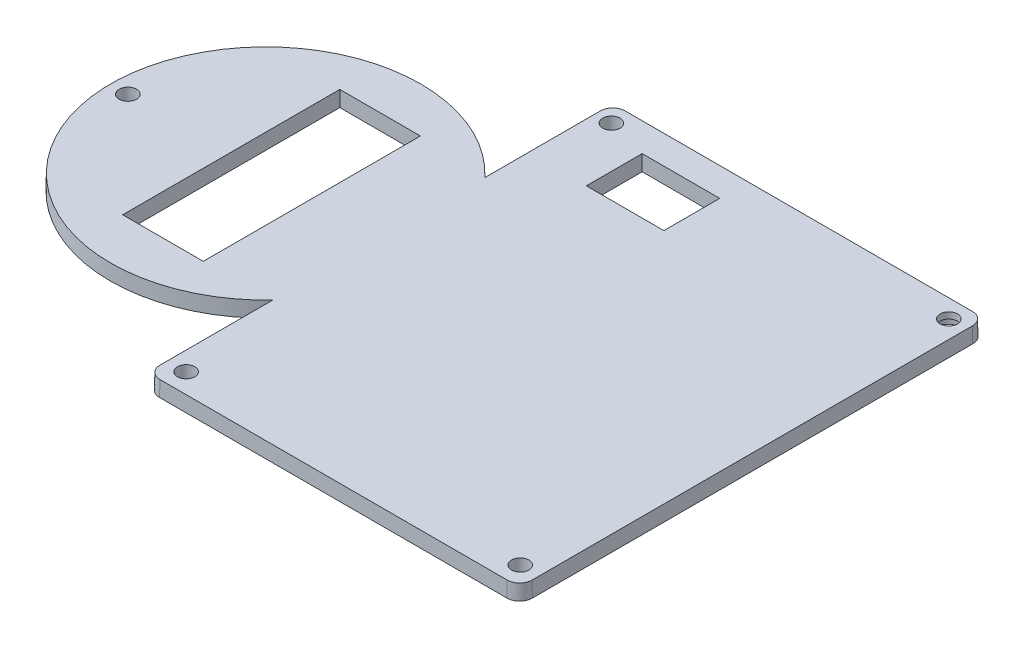
ISO-10303-21;
HEADER;
FILE_DESCRIPTION(('STEP AP214'),'2;1');
FILE_NAME('part.step','',(''),(''),'','','');
FILE_SCHEMA(('AUTOMOTIVE_DESIGN { 1 0 10303 214 1 1 1 1 }'));
ENDSEC;
DATA;
#1=APPLICATION_CONTEXT('core data for automotive mechanical design processes');
#2=APPLICATION_PROTOCOL_DEFINITION('international standard','automotive_design',2000,#1);
#3=PRODUCT_CONTEXT('',#1,'mechanical');
#4=PRODUCT('Part','Part','',(#3));
#5=PRODUCT_RELATED_PRODUCT_CATEGORY('part','',(#4));
#6=PRODUCT_DEFINITION_FORMATION('','',#4);
#7=PRODUCT_DEFINITION_CONTEXT('part definition',#1,'design');
#8=PRODUCT_DEFINITION('design','',#6,#7);
#9=PRODUCT_DEFINITION_SHAPE('','',#8);
#10=(LENGTH_UNIT() NAMED_UNIT(*) SI_UNIT(.MILLI.,.METRE.));
#11=(NAMED_UNIT(*) PLANE_ANGLE_UNIT() SI_UNIT($,.RADIAN.));
#12=(NAMED_UNIT(*) SI_UNIT($,.STERADIAN.) SOLID_ANGLE_UNIT());
#13=UNCERTAINTY_MEASURE_WITH_UNIT(LENGTH_MEASURE(1.E-05),#10,'distance_accuracy_value','');
#14=(GEOMETRIC_REPRESENTATION_CONTEXT(3) GLOBAL_UNCERTAINTY_ASSIGNED_CONTEXT((#13)) GLOBAL_UNIT_ASSIGNED_CONTEXT((#10,
#11,#12)) REPRESENTATION_CONTEXT('',''));
#15=CARTESIAN_POINT('',(0.,0.,0.));
#16=DIRECTION('',(0.,0.,1.));
#17=DIRECTION('',(1.,0.,0.));
#18=AXIS2_PLACEMENT_3D('',#15,#16,#17);
#19=CARTESIAN_POINT('',(13.7088550827018,5.,-147.164227743625));
#20=DIRECTION('',(-0.999847695156391,0.0174524064372835,0.));
#21=DIRECTION('',(-0.0174524064372835,-0.999847695156391,0.));
#22=AXIS2_PLACEMENT_3D('',#19,#20,#21);
#23=PLANE('',#22);
#24=DIRECTION('',(0.,0.,-1.));
#25=VECTOR('',#24,1.);
#26=CARTESIAN_POINT('',(13.6215797580607,0.,-147.164227743625));
#27=LINE('',#26,#25);
#28=CARTESIAN_POINT('',(13.6215797580607,0.,-37.3430465346885));
#29=VERTEX_POINT('',#28);
#30=CARTESIAN_POINT('',(13.6215797580607,0.,-1.16422774362512));
#31=VERTEX_POINT('',#30);
#32=EDGE_CURVE('E436',#29,#31,#27,.F.);
#33=ORIENTED_EDGE('',*,*,#32,.T.);
#34=DIRECTION('',(-0.0174524064372835,-0.999847695156391,0.));
#35=VECTOR('',#34,1.);
#36=CARTESIAN_POINT('',(13.7088550827018,5.,-1.16422774362512));
#37=LINE('',#36,#35);
#38=CARTESIAN_POINT('',(13.7088550827018,5.,-1.16422774362512));
#39=VERTEX_POINT('',#38);
#40=EDGE_CURVE('E189',#31,#39,#37,.F.);
#41=ORIENTED_EDGE('',*,*,#40,.T.);
#42=DIRECTION('',(0.,0.,1.));
#43=VECTOR('',#42,1.);
#44=CARTESIAN_POINT('',(13.7088550827018,5.,-147.164227743625));
#45=LINE('',#44,#43);
#46=CARTESIAN_POINT('',(13.7088550827018,5.,-37.5631420610925));
#47=VERTEX_POINT('',#46);
#48=EDGE_CURVE('E393',#47,#39,#45,.T.);
#49=ORIENTED_EDGE('',*,*,#48,.F.);
#50=CARTESIAN_POINT('',(13.6215797580607,0.,-37.3430465346885));
#51=CARTESIAN_POINT('',(13.63612573574,0.833338503129155,-37.3796116421935));
#52=CARTESIAN_POINT('',(13.6506716682997,1.6666744213586,-37.4162354898129));
#53=CARTESIAN_POINT('',(13.6797634431801,3.33334108802526,-37.4896006652809));
#54=CARTESIAN_POINT('',(13.6943092855008,4.16667183646249,-37.5263419931294));
#55=CARTESIAN_POINT('',(13.7088550827018,5.,-37.5631420610925));
#56=B_SPLINE_CURVE_WITH_KNOTS('',3,(#50,#51,#52,#53,#54,#55),.UNSPECIFIED.,.F.,.F.,(4,2,4),(0.,
2.50280138780888,5.00560277563944),.UNSPECIFIED.);
#57=EDGE_CURVE('E209',#29,#47,#56,.T.);
#58=ORIENTED_EDGE('',*,*,#57,.F.);
#59=EDGE_LOOP('',(#33,#41,#49,#58));
#60=FACE_BOUND('',#59,.T.);
#61=ADVANCED_FACE('F39',(#60),#23,.T.);
#62=CARTESIAN_POINT('',(13.7088550827018,5.,-147.164227743625));
#63=DIRECTION('',(-0.999847695156391,0.0174524064372835,0.));
#64=DIRECTION('',(-0.0174524064372835,-0.999847695156391,0.));
#65=AXIS2_PLACEMENT_3D('',#62,#63,#64);
#66=PLANE('',#65);
#67=CARTESIAN_POINT('',(13.7088550827018,5.,-143.164227743625));
#68=VERTEX_POINT('',#67);
#69=CARTESIAN_POINT('',(13.7088550827018,5.,-105.933775442334));
#70=VERTEX_POINT('',#69);
#71=EDGE_CURVE('E390',#68,#70,#45,.T.);
#72=ORIENTED_EDGE('',*,*,#71,.F.);
#73=DIRECTION('',(-0.0174524064372835,-0.999847695156391,0.));
#74=VECTOR('',#73,1.);
#75=CARTESIAN_POINT('',(13.7088550827018,5.,-143.164227743625));
#76=LINE('',#75,#74);
#77=CARTESIAN_POINT('',(13.6215797580607,0.,-143.164227743625));
#78=VERTEX_POINT('',#77);
#79=EDGE_CURVE('E191',#68,#78,#76,.T.);
#80=ORIENTED_EDGE('',*,*,#79,.T.);
#81=DIRECTION('',(0.,0.,-1.));
#82=VECTOR('',#81,1.);
#83=CARTESIAN_POINT('',(13.6215797580607,0.,-147.164227743625));
#84=LINE('',#83,#82);
#85=CARTESIAN_POINT('',(13.6215797580607,0.,-106.153870968738));
#86=VERTEX_POINT('',#85);
#87=EDGE_CURVE('E433',#78,#86,#84,.F.);
#88=ORIENTED_EDGE('',*,*,#87,.T.);
#89=CARTESIAN_POINT('',(13.7088550827018,5.,-105.933775442334));
#90=CARTESIAN_POINT('',(13.6943092855008,4.16667183646249,-105.970575510297));
#91=CARTESIAN_POINT('',(13.6797634431801,3.33334108802526,-106.007316838146));
#92=CARTESIAN_POINT('',(13.6506716682997,1.6666744213586,-106.080682013614));
#93=CARTESIAN_POINT('',(13.63612573574,0.833338503129156,-106.117305861233));
#94=CARTESIAN_POINT('',(13.6215797580607,0.,-106.153870968738));
#95=B_SPLINE_CURVE_WITH_KNOTS('',3,(#89,#90,#91,#92,#93,#94),.UNSPECIFIED.,.F.,.F.,(4,2,4),(0.,
2.50280138783056,5.00560277563944),.UNSPECIFIED.);
#96=EDGE_CURVE('E200',#70,#86,#95,.T.);
#97=ORIENTED_EDGE('',*,*,#96,.F.);
#98=EDGE_LOOP('',(#72,#80,#88,#97));
#99=FACE_BOUND('',#98,.T.);
#100=ADVANCED_FACE('F217',(#99),#66,.T.);
#101=CARTESIAN_POINT('',(13.7088550827018,5.,2.83577225637488));
#102=DIRECTION('',(0.,0.0174524064372835,0.999847695156391));
#103=DIRECTION('',(0.,-0.999847695156391,0.0174524064372835));
#104=AXIS2_PLACEMENT_3D('',#101,#102,#103);
#105=PLANE('',#104);
#106=DIRECTION('',(-1.,0.,0.));
#107=VECTOR('',#106,1.);
#108=CARTESIAN_POINT('',(13.7088550827018,0.,2.92304758101597));
#109=LINE('',#108,#107);
#110=CARTESIAN_POINT('',(17.7088550827018,0.,2.92304758101597));
#111=VERTEX_POINT('',#110);
#112=CARTESIAN_POINT('',(129.708855082702,0.,2.92304758101597));
#113=VERTEX_POINT('',#112);
#114=EDGE_CURVE('E435',#111,#113,#109,.F.);
#115=ORIENTED_EDGE('',*,*,#114,.T.);
#116=DIRECTION('',(0.,-0.999847695156391,0.0174524064372835));
#117=VECTOR('',#116,1.);
#118=CARTESIAN_POINT('',(129.708855082702,5.,2.83577225637488));
#119=LINE('',#118,#117);
#120=CARTESIAN_POINT('',(129.708855082702,5.,2.83577225637488));
#121=VERTEX_POINT('',#120);
#122=EDGE_CURVE('E43',#113,#121,#119,.F.);
#123=ORIENTED_EDGE('',*,*,#122,.T.);
#124=DIRECTION('',(1.,0.,0.));
#125=VECTOR('',#124,1.);
#126=CARTESIAN_POINT('',(13.7088550827018,5.,2.83577225637488));
#127=LINE('',#126,#125);
#128=CARTESIAN_POINT('',(17.7088550827018,5.,2.83577225637488));
#129=VERTEX_POINT('',#128);
#130=EDGE_CURVE('E392',#129,#121,#127,.T.);
#131=ORIENTED_EDGE('',*,*,#130,.F.);
#132=DIRECTION('',(0.,-0.999847695156391,0.0174524064372835));
#133=VECTOR('',#132,1.);
#134=CARTESIAN_POINT('',(17.7088550827018,5.,2.83577225637488));
#135=LINE('',#134,#133);
#136=EDGE_CURVE('E302',#129,#111,#135,.T.);
#137=ORIENTED_EDGE('',*,*,#136,.T.);
#138=EDGE_LOOP('',(#115,#123,#131,#137));
#139=FACE_BOUND('',#138,.T.);
#140=ADVANCED_FACE('F41',(#139),#105,.T.);
#141=CARTESIAN_POINT('',(133.708855082702,5.,-147.164227743625));
#142=DIRECTION('',(0.999847695156391,0.0174524064372835,0.));
#143=DIRECTION('',(-0.0174524064372835,0.999847695156391,0.));
#144=AXIS2_PLACEMENT_3D('',#141,#142,#143);
#145=PLANE('',#144);
#146=DIRECTION('',(0.,0.,1.));
#147=VECTOR('',#146,1.);
#148=CARTESIAN_POINT('',(133.708855082702,5.,-147.164227743625));
#149=LINE('',#148,#147);
#150=CARTESIAN_POINT('',(133.708855082702,5.,-143.164227743625));
#151=VERTEX_POINT('',#150);
#152=CARTESIAN_POINT('',(133.708855082702,5.,-1.16422774362512));
#153=VERTEX_POINT('',#152);
#154=EDGE_CURVE('E170',#151,#153,#149,.T.);
#155=ORIENTED_EDGE('',*,*,#154,.T.);
#156=DIRECTION('',(0.0174524064372835,-0.999847695156391,0.));
#157=VECTOR('',#156,1.);
#158=CARTESIAN_POINT('',(133.708855082702,5.,-1.16422774362512));
#159=LINE('',#158,#157);
#160=CARTESIAN_POINT('',(133.796130407343,0.,-1.16422774362512));
#161=VERTEX_POINT('',#160);
#162=EDGE_CURVE('E195',#153,#161,#159,.T.);
#163=ORIENTED_EDGE('',*,*,#162,.T.);
#164=DIRECTION('',(0.,0.,1.));
#165=VECTOR('',#164,1.);
#166=CARTESIAN_POINT('',(133.796130407343,0.,-147.164227743625));
#167=LINE('',#166,#165);
#168=CARTESIAN_POINT('',(133.796130407343,0.,-143.164227743625));
#169=VERTEX_POINT('',#168);
#170=EDGE_CURVE('E431',#169,#161,#167,.T.);
#171=ORIENTED_EDGE('',*,*,#170,.F.);
#172=DIRECTION('',(0.0174524064372835,-0.999847695156391,0.));
#173=VECTOR('',#172,1.);
#174=CARTESIAN_POINT('',(133.708855082702,5.,-143.164227743625));
#175=LINE('',#174,#173);
#176=EDGE_CURVE('E185',#169,#151,#175,.F.);
#177=ORIENTED_EDGE('',*,*,#176,.T.);
#178=EDGE_LOOP('',(#155,#163,#171,#177));
#179=FACE_BOUND('',#178,.T.);
#180=ADVANCED_FACE('F280',(#179),#145,.T.);
#181=CARTESIAN_POINT('',(13.7088550827018,5.,-147.164227743625));
#182=DIRECTION('',(0.,0.0174524064372835,-0.999847695156391));
#183=DIRECTION('',(0.,0.999847695156391,0.0174524064372835));
#184=AXIS2_PLACEMENT_3D('',#181,#182,#183);
#185=PLANE('',#184);
#186=DIRECTION('',(1.,0.,0.));
#187=VECTOR('',#186,1.);
#188=CARTESIAN_POINT('',(13.7088550827018,5.,-147.164227743625));
#189=LINE('',#188,#187);
#190=CARTESIAN_POINT('',(17.7088550827018,5.,-147.164227743625));
#191=VERTEX_POINT('',#190);
#192=CARTESIAN_POINT('',(129.708855082702,5.,-147.164227743625));
#193=VERTEX_POINT('',#192);
#194=EDGE_CURVE('E167',#191,#193,#189,.T.);
#195=ORIENTED_EDGE('',*,*,#194,.T.);
#196=DIRECTION('',(0.,-0.999847695156391,-0.0174524064372835));
#197=VECTOR('',#196,1.);
#198=CARTESIAN_POINT('',(129.708855082702,5.,-147.164227743625));
#199=LINE('',#198,#197);
#200=CARTESIAN_POINT('',(129.708855082702,0.,-147.251503068266));
#201=VERTEX_POINT('',#200);
#202=EDGE_CURVE('E181',#193,#201,#199,.T.);
#203=ORIENTED_EDGE('',*,*,#202,.T.);
#204=DIRECTION('',(1.,0.,0.));
#205=VECTOR('',#204,1.);
#206=CARTESIAN_POINT('',(13.7088550827018,0.,-147.251503068266));
#207=LINE('',#206,#205);
#208=CARTESIAN_POINT('',(17.7088550827018,0.,-147.251503068266));
#209=VERTEX_POINT('',#208);
#210=EDGE_CURVE('E430',#209,#201,#207,.T.);
#211=ORIENTED_EDGE('',*,*,#210,.F.);
#212=DIRECTION('',(0.,-0.999847695156391,-0.0174524064372835));
#213=VECTOR('',#212,1.);
#214=CARTESIAN_POINT('',(17.7088550827018,5.,-147.164227743625));
#215=LINE('',#214,#213);
#216=EDGE_CURVE('E184',#209,#191,#215,.F.);
#217=ORIENTED_EDGE('',*,*,#216,.T.);
#218=EDGE_LOOP('',(#195,#203,#211,#217));
#219=FACE_BOUND('',#218,.T.);
#220=ADVANCED_FACE('F179',(#219),#185,.T.);
#221=CARTESIAN_POINT('',(0.,5.,0.));
#222=DIRECTION('',(0.,1.,0.));
#223=DIRECTION('',(0.,0.,1.));
#224=AXIS2_PLACEMENT_3D('',#221,#222,#223);
#225=PLANE('',#224);
#226=DIRECTION('',(0.,0.,-1.));
#227=VECTOR('',#226,1.);
#228=CARTESIAN_POINT('',(57.3758983763834,5.,-137.99167248453));
#229=LINE('',#228,#227);
#230=CARTESIAN_POINT('',(57.3758983763834,5.,-119.99167248453));
#231=VERTEX_POINT('',#230);
#232=CARTESIAN_POINT('',(57.3758983763834,5.,-137.99167248453));
#233=VERTEX_POINT('',#232);
#234=EDGE_CURVE('E58',#231,#233,#229,.T.);
#235=ORIENTED_EDGE('',*,*,#234,.F.);
#236=DIRECTION('',(1.,0.,0.));
#237=VECTOR('',#236,1.);
#238=CARTESIAN_POINT('',(32.3758983763834,5.,-119.99167248453));
#239=LINE('',#238,#237);
#240=CARTESIAN_POINT('',(32.3758983763834,5.,-119.99167248453));
#241=VERTEX_POINT('',#240);
#242=EDGE_CURVE('E366',#241,#231,#239,.T.);
#243=ORIENTED_EDGE('',*,*,#242,.F.);
#244=DIRECTION('',(0.,0.,1.));
#245=VECTOR('',#244,1.);
#246=CARTESIAN_POINT('',(32.3758983763834,5.,-137.99167248453));
#247=LINE('',#246,#245);
#248=CARTESIAN_POINT('',(32.3758983763834,5.,-137.99167248453));
#249=VERTEX_POINT('',#248);
#250=EDGE_CURVE('E685',#249,#241,#247,.T.);
#251=ORIENTED_EDGE('',*,*,#250,.F.);
#252=DIRECTION('',(-1.,0.,0.));
#253=VECTOR('',#252,1.);
#254=CARTESIAN_POINT('',(32.3758983763834,5.,-137.99167248453));
#255=LINE('',#254,#253);
#256=EDGE_CURVE('E690',#233,#249,#255,.T.);
#257=ORIENTED_EDGE('',*,*,#256,.F.);
#258=EDGE_LOOP('',(#235,#243,#251,#257));
#259=FACE_BOUND('',#258,.T.);
#260=DIRECTION('',(0.,0.,-1.));
#261=VECTOR('',#260,1.);
#262=CARTESIAN_POINT('',(-8.2911449172982,5.,-37.1642277436251));
#263=LINE('',#262,#261);
#264=CARTESIAN_POINT('',(-8.2911449172982,5.,-37.1642277436251));
#265=VERTEX_POINT('',#264);
#266=CARTESIAN_POINT('',(-8.2911449172982,5.,-107.164227743625));
#267=VERTEX_POINT('',#266);
#268=EDGE_CURVE('E354',#265,#267,#263,.T.);
#269=ORIENTED_EDGE('',*,*,#268,.F.);
#270=DIRECTION('',(1.,0.,0.));
#271=VECTOR('',#270,1.);
#272=CARTESIAN_POINT('',(-34.2911449172982,5.,-37.1642277436251));
#273=LINE('',#272,#271);
#274=CARTESIAN_POINT('',(-34.2911449172982,5.,-37.1642277436251));
#275=VERTEX_POINT('',#274);
#276=EDGE_CURVE('E336',#275,#265,#273,.T.);
#277=ORIENTED_EDGE('',*,*,#276,.F.);
#278=DIRECTION('',(0.,0.,1.));
#279=VECTOR('',#278,1.);
#280=CARTESIAN_POINT('',(-34.2911449172982,5.,-37.1642277436251));
#281=LINE('',#280,#279);
#282=CARTESIAN_POINT('',(-34.2911449172982,5.,-107.164227743625));
#283=VERTEX_POINT('',#282);
#284=EDGE_CURVE('E361',#283,#275,#281,.T.);
#285=ORIENTED_EDGE('',*,*,#284,.F.);
#286=DIRECTION('',(-1.,0.,0.));
#287=VECTOR('',#286,1.);
#288=CARTESIAN_POINT('',(-34.2911449172982,5.,-107.164227743625));
#289=LINE('',#288,#287);
#290=EDGE_CURVE('E358',#267,#283,#289,.T.);
#291=ORIENTED_EDGE('',*,*,#290,.F.);
#292=EDGE_LOOP('',(#269,#277,#285,#291));
#293=FACE_BOUND('',#292,.T.);
#294=CARTESIAN_POINT('',(18.9171232014785,5.,-141.531370061939));
#295=DIRECTION('',(0.,1.,0.));
#296=DIRECTION('',(0.,0.,1.));
#297=AXIS2_PLACEMENT_3D('',#294,#295,#296);
#298=CIRCLE('',#297,2.8067);
#299=CARTESIAN_POINT('',(18.9171232014785,5.,-138.724670061939));
#300=VERTEX_POINT('',#299);
#301=EDGE_CURVE('E333',#300,#300,#298,.T.);
#302=ORIENTED_EDGE('',*,*,#301,.F.);
#303=EDGE_LOOP('',(#302));
#304=FACE_BOUND('',#303,.T.);
#305=CARTESIAN_POINT('',(127.969984406632,5.,-141.269223760965));
#306=DIRECTION('',(0.,1.,0.));
#307=DIRECTION('',(0.,0.,1.));
#308=AXIS2_PLACEMENT_3D('',#305,#306,#307);
#309=CIRCLE('',#308,2.8067);
#310=CARTESIAN_POINT('',(127.969984406632,5.,-138.462523760965));
#311=VERTEX_POINT('',#310);
#312=EDGE_CURVE('E374',#311,#311,#309,.T.);
#313=ORIENTED_EDGE('',*,*,#312,.F.);
#314=EDGE_LOOP('',(#313));
#315=FACE_BOUND('',#314,.T.);
#316=CARTESIAN_POINT('',(127.602547563754,5.,-3.45328248038996));
#317=DIRECTION('',(0.,1.,0.));
#318=DIRECTION('',(0.,0.,1.));
#319=AXIS2_PLACEMENT_3D('',#316,#317,#318);
#320=CIRCLE('',#319,2.8067);
#321=CARTESIAN_POINT('',(127.602547563754,5.,-0.646582480389964));
#322=VERTEX_POINT('',#321);
#323=EDGE_CURVE('E378',#322,#322,#320,.T.);
#324=ORIENTED_EDGE('',*,*,#323,.F.);
#325=EDGE_LOOP('',(#324));
#326=FACE_BOUND('',#325,.T.);
#327=CARTESIAN_POINT('',(19.774147178092,5.,-3.57057546629465));
#328=DIRECTION('',(0.,1.,0.));
#329=DIRECTION('',(0.,0.,1.));
#330=AXIS2_PLACEMENT_3D('',#327,#328,#329);
#331=CIRCLE('',#330,2.8067);
#332=CARTESIAN_POINT('',(19.774147178092,5.,-0.76387546629465));
#333=VERTEX_POINT('',#332);
#334=EDGE_CURVE('E382',#333,#333,#331,.T.);
#335=ORIENTED_EDGE('',*,*,#334,.F.);
#336=EDGE_LOOP('',(#335));
#337=FACE_BOUND('',#336,.T.);
#338=CARTESIAN_POINT('',(-67.1156180642392,5.,-71.668740496135));
#339=DIRECTION('',(0.,1.,0.));
#340=DIRECTION('',(0.,0.,1.));
#341=AXIS2_PLACEMENT_3D('',#338,#339,#340);
#342=CIRCLE('',#341,2.8067);
#343=CARTESIAN_POINT('',(-67.1156180642392,5.,-68.862040496135));
#344=VERTEX_POINT('',#343);
#345=EDGE_CURVE('E326',#344,#344,#342,.T.);
#346=ORIENTED_EDGE('',*,*,#345,.F.);
#347=EDGE_LOOP('',(#346));
#348=FACE_BOUND('',#347,.T.);
#349=ORIENTED_EDGE('',*,*,#130,.T.);
#350=CARTESIAN_POINT('',(129.708855082702,5.,-1.16422774362512));
#351=DIRECTION('',(0.,1.,0.));
#352=DIRECTION('',(0.,0.,1.));
#353=AXIS2_PLACEMENT_3D('',#350,#351,#352);
#354=CIRCLE('',#353,4.);
#355=EDGE_CURVE('E174',#121,#153,#354,.T.);
#356=ORIENTED_EDGE('',*,*,#355,.T.);
#357=ORIENTED_EDGE('',*,*,#154,.F.);
#358=CARTESIAN_POINT('',(129.708855082702,5.,-143.164227743625));
#359=DIRECTION('',(0.,1.,0.));
#360=DIRECTION('',(0.,0.,1.));
#361=AXIS2_PLACEMENT_3D('',#358,#359,#360);
#362=CIRCLE('',#361,4.);
#363=EDGE_CURVE('E163',#151,#193,#362,.T.);
#364=ORIENTED_EDGE('',*,*,#363,.T.);
#365=ORIENTED_EDGE('',*,*,#194,.F.);
#366=CARTESIAN_POINT('',(17.7088550827018,5.,-143.164227743625));
#367=DIRECTION('',(0.,1.,0.));
#368=DIRECTION('',(0.,0.,1.));
#369=AXIS2_PLACEMENT_3D('',#366,#367,#368);
#370=CIRCLE('',#369,4.);
#371=EDGE_CURVE('E305',#191,#68,#370,.T.);
#372=ORIENTED_EDGE('',*,*,#371,.T.);
#373=ORIENTED_EDGE('',*,*,#71,.T.);
#374=CARTESIAN_POINT('',(-22.7790075946593,5.,-71.7484587517132));
#375=DIRECTION('',(0.,1.,0.));
#376=DIRECTION('',(0.,0.,1.));
#377=AXIS2_PLACEMENT_3D('',#374,#375,#376);
#378=CIRCLE('',#377,50.);
#379=EDGE_CURVE('E210',#70,#47,#378,.T.);
#380=ORIENTED_EDGE('',*,*,#379,.T.);
#381=ORIENTED_EDGE('',*,*,#48,.T.);
#382=CARTESIAN_POINT('',(17.7088550827018,5.,-1.16422774362512));
#383=DIRECTION('',(0.,1.,0.));
#384=DIRECTION('',(0.,0.,1.));
#385=AXIS2_PLACEMENT_3D('',#382,#383,#384);
#386=CIRCLE('',#385,4.);
#387=EDGE_CURVE('E175',#39,#129,#386,.T.);
#388=ORIENTED_EDGE('',*,*,#387,.T.);
#389=EDGE_LOOP('',(#349,#356,#357,#364,#365,#372,#373,#380,#381,#388));
#390=FACE_BOUND('',#389,.T.);
#391=ADVANCED_FACE('F166',(#259,#293,#304,#315,#326,#337,#348,#390),#225,.T.);
#392=CARTESIAN_POINT('',(0.,0.,0.));
#393=DIRECTION('',(0.,1.,0.));
#394=DIRECTION('',(0.,0.,1.));
#395=AXIS2_PLACEMENT_3D('',#392,#393,#394);
#396=PLANE('',#395);
#397=DIRECTION('',(-1.,0.,0.));
#398=VECTOR('',#397,1.);
#399=CARTESIAN_POINT('',(0.,0.,-120.078947809171));
#400=LINE('',#399,#398);
#401=CARTESIAN_POINT('',(32.4631737010245,0.,-120.078947809171));
#402=VERTEX_POINT('',#401);
#403=CARTESIAN_POINT('',(57.2886230517423,0.,-120.078947809171));
#404=VERTEX_POINT('',#403);
#405=EDGE_CURVE('E49',#402,#404,#400,.F.);
#406=ORIENTED_EDGE('',*,*,#405,.T.);
#407=DIRECTION('',(0.,0.,1.));
#408=VECTOR('',#407,1.);
#409=CARTESIAN_POINT('',(57.2886230517423,0.,0.));
#410=LINE('',#409,#408);
#411=CARTESIAN_POINT('',(57.2886230517423,0.,-137.904397159889));
#412=VERTEX_POINT('',#411);
#413=EDGE_CURVE('E11',#404,#412,#410,.F.);
#414=ORIENTED_EDGE('',*,*,#413,.T.);
#415=DIRECTION('',(1.,0.,0.));
#416=VECTOR('',#415,1.);
#417=CARTESIAN_POINT('',(0.,0.,-137.904397159889));
#418=LINE('',#417,#416);
#419=CARTESIAN_POINT('',(32.4631737010245,0.,-137.904397159889));
#420=VERTEX_POINT('',#419);
#421=EDGE_CURVE('E345',#412,#420,#418,.F.);
#422=ORIENTED_EDGE('',*,*,#421,.T.);
#423=DIRECTION('',(0.,0.,-1.));
#424=VECTOR('',#423,1.);
#425=CARTESIAN_POINT('',(32.4631737010245,0.,0.));
#426=LINE('',#425,#424);
#427=EDGE_CURVE('E409',#420,#402,#426,.F.);
#428=ORIENTED_EDGE('',*,*,#427,.T.);
#429=EDGE_LOOP('',(#406,#414,#422,#428));
#430=FACE_BOUND('',#429,.T.);
#431=DIRECTION('',(-1.,0.,0.));
#432=VECTOR('',#431,1.);
#433=CARTESIAN_POINT('',(0.,0.,-37.2515030682662));
#434=LINE('',#433,#432);
#435=CARTESIAN_POINT('',(-34.2038695926571,0.,-37.2515030682662));
#436=VERTEX_POINT('',#435);
#437=CARTESIAN_POINT('',(-8.37842024193929,0.,-37.2515030682662));
#438=VERTEX_POINT('',#437);
#439=EDGE_CURVE('E340',#436,#438,#434,.F.);
#440=ORIENTED_EDGE('',*,*,#439,.T.);
#441=DIRECTION('',(0.,0.,1.));
#442=VECTOR('',#441,1.);
#443=CARTESIAN_POINT('',(-8.37842024193929,0.,0.));
#444=LINE('',#443,#442);
#445=CARTESIAN_POINT('',(-8.37842024193929,0.,-107.076952418984));
#446=VERTEX_POINT('',#445);
#447=EDGE_CURVE('E343',#438,#446,#444,.F.);
#448=ORIENTED_EDGE('',*,*,#447,.T.);
#449=DIRECTION('',(1.,0.,0.));
#450=VECTOR('',#449,1.);
#451=CARTESIAN_POINT('',(0.,0.,-107.076952418984));
#452=LINE('',#451,#450);
#453=CARTESIAN_POINT('',(-34.2038695926571,0.,-107.076952418984));
#454=VERTEX_POINT('',#453);
#455=EDGE_CURVE('E199',#446,#454,#452,.F.);
#456=ORIENTED_EDGE('',*,*,#455,.T.);
#457=DIRECTION('',(0.,0.,-1.));
#458=VECTOR('',#457,1.);
#459=CARTESIAN_POINT('',(-34.2038695926571,0.,0.));
#460=LINE('',#459,#458);
#461=EDGE_CURVE('E337',#454,#436,#460,.F.);
#462=ORIENTED_EDGE('',*,*,#461,.T.);
#463=EDGE_LOOP('',(#440,#448,#456,#462));
#464=FACE_BOUND('',#463,.T.);
#465=CARTESIAN_POINT('',(18.9171232014785,0.,-141.531370061939));
#466=DIRECTION('',(0.,1.,0.));
#467=DIRECTION('',(0.,0.,1.));
#468=AXIS2_PLACEMENT_3D('',#465,#466,#467);
#469=CIRCLE('',#468,2.71942467535891);
#470=CARTESIAN_POINT('',(18.9171232014785,0.,-138.81194538658));
#471=VERTEX_POINT('',#470);
#472=EDGE_CURVE('E373',#471,#471,#469,.T.);
#473=ORIENTED_EDGE('',*,*,#472,.T.);
#474=EDGE_LOOP('',(#473));
#475=FACE_BOUND('',#474,.T.);
#476=CARTESIAN_POINT('',(127.602547563754,0.,-3.45328248038996));
#477=DIRECTION('',(0.,1.,0.));
#478=DIRECTION('',(0.,0.,1.));
#479=AXIS2_PLACEMENT_3D('',#476,#477,#478);
#480=CIRCLE('',#479,2.71942467535891);
#481=CARTESIAN_POINT('',(127.602547563754,0.,-0.733857805031052));
#482=VERTEX_POINT('',#481);
#483=EDGE_CURVE('E381',#482,#482,#480,.T.);
#484=ORIENTED_EDGE('',*,*,#483,.T.);
#485=EDGE_LOOP('',(#484));
#486=FACE_BOUND('',#485,.T.);
#487=CARTESIAN_POINT('',(-67.1156180642392,0.,-71.668740496135));
#488=DIRECTION('',(0.,1.,0.));
#489=DIRECTION('',(0.,0.,1.));
#490=AXIS2_PLACEMENT_3D('',#487,#488,#489);
#491=CIRCLE('',#490,2.71942467535891);
#492=CARTESIAN_POINT('',(-67.1156180642392,0.,-68.9493158207761));
#493=VERTEX_POINT('',#492);
#494=EDGE_CURVE('E321',#493,#493,#491,.T.);
#495=ORIENTED_EDGE('',*,*,#494,.T.);
#496=EDGE_LOOP('',(#495));
#497=FACE_BOUND('',#496,.T.);
#498=CARTESIAN_POINT('',(127.708855082702,0.,-141.164227743625));
#499=DIRECTION('',(0.,1.,0.));
#500=DIRECTION('',(0.,0.,1.));
#501=AXIS2_PLACEMENT_3D('',#498,#499,#500);
#502=CIRCLE('',#501,4.82544935071781);
#503=CARTESIAN_POINT('',(127.708855082702,0.,-136.338778392907));
#504=VERTEX_POINT('',#503);
#505=EDGE_CURVE('E314',#504,#504,#502,.T.);
#506=ORIENTED_EDGE('',*,*,#505,.T.);
#507=EDGE_LOOP('',(#506));
#508=FACE_BOUND('',#507,.T.);
#509=CARTESIAN_POINT('',(19.7088550827018,0.,-3.16422774362512));
#510=DIRECTION('',(0.,1.,0.));
#511=DIRECTION('',(0.,0.,1.));
#512=AXIS2_PLACEMENT_3D('',#509,#510,#511);
#513=CIRCLE('',#512,5.28577130179794);
#514=CARTESIAN_POINT('',(19.7088550827018,0.,2.12154355817282));
#515=VERTEX_POINT('',#514);
#516=EDGE_CURVE('E313',#515,#515,#513,.F.);
#517=ORIENTED_EDGE('',*,*,#516,.F.);
#518=EDGE_LOOP('',(#517));
#519=FACE_BOUND('',#518,.T.);
#520=ORIENTED_EDGE('',*,*,#170,.T.);
#521=CARTESIAN_POINT('',(129.708855082702,0.,-1.16422774362512));
#522=DIRECTION('',(0.,1.,0.));
#523=DIRECTION('',(0.,0.,1.));
#524=AXIS2_PLACEMENT_3D('',#521,#522,#523);
#525=CIRCLE('',#524,4.08727532464109);
#526=EDGE_CURVE('E401',#161,#113,#525,.F.);
#527=ORIENTED_EDGE('',*,*,#526,.T.);
#528=ORIENTED_EDGE('',*,*,#114,.F.);
#529=CARTESIAN_POINT('',(17.7088550827018,0.,-1.16422774362512));
#530=DIRECTION('',(0.,1.,0.));
#531=DIRECTION('',(0.,0.,1.));
#532=AXIS2_PLACEMENT_3D('',#529,#530,#531);
#533=CIRCLE('',#532,4.08727532464109);
#534=EDGE_CURVE('E403',#111,#31,#533,.F.);
#535=ORIENTED_EDGE('',*,*,#534,.T.);
#536=ORIENTED_EDGE('',*,*,#32,.F.);
#537=CARTESIAN_POINT('',(-22.7790075946593,0.,-71.7484587517132));
#538=DIRECTION('',(0.,1.,0.));
#539=DIRECTION('',(0.,0.,1.));
#540=AXIS2_PLACEMENT_3D('',#537,#538,#539);
#541=CIRCLE('',#540,50.0872753246411);
#542=EDGE_CURVE('E317',#86,#29,#541,.T.);
#543=ORIENTED_EDGE('',*,*,#542,.F.);
#544=ORIENTED_EDGE('',*,*,#87,.F.);
#545=CARTESIAN_POINT('',(17.7088550827018,0.,-143.164227743625));
#546=DIRECTION('',(0.,1.,0.));
#547=DIRECTION('',(0.,0.,1.));
#548=AXIS2_PLACEMENT_3D('',#545,#546,#547);
#549=CIRCLE('',#548,4.08727532464109);
#550=EDGE_CURVE('E402',#78,#209,#549,.F.);
#551=ORIENTED_EDGE('',*,*,#550,.T.);
#552=ORIENTED_EDGE('',*,*,#210,.T.);
#553=CARTESIAN_POINT('',(129.708855082702,0.,-143.164227743625));
#554=DIRECTION('',(0.,1.,0.));
#555=DIRECTION('',(0.,0.,1.));
#556=AXIS2_PLACEMENT_3D('',#553,#554,#555);
#557=CIRCLE('',#556,4.08727532464109);
#558=EDGE_CURVE('E188',#201,#169,#557,.F.);
#559=ORIENTED_EDGE('',*,*,#558,.T.);
#560=EDGE_LOOP('',(#520,#527,#528,#535,#536,#543,#544,#551,#552,#559));
#561=FACE_BOUND('',#560,.T.);
#562=ADVANCED_FACE('F224',(#430,#464,#475,#486,#497,#508,#519,#561),#396,.F.);
#563=CARTESIAN_POINT('',(-22.7790075946593,5.,-71.7484587517132));
#564=DIRECTION('',(0.,-1.,0.));
#565=DIRECTION('',(0.,0.,1.));
#566=AXIS2_PLACEMENT_3D('',#563,#564,#565);
#567=CONICAL_SURFACE('',#566,50.,0.0174532925199433);
#568=ORIENTED_EDGE('',*,*,#542,.T.);
#569=ORIENTED_EDGE('',*,*,#57,.T.);
#570=ORIENTED_EDGE('',*,*,#379,.F.);
#571=ORIENTED_EDGE('',*,*,#96,.T.);
#572=EDGE_LOOP('',(#568,#569,#570,#571));
#573=FACE_BOUND('',#572,.T.);
#574=ADVANCED_FACE('F220',(#573),#567,.T.);
#575=CARTESIAN_POINT('',(19.7088550827018,5.,-3.16422774362512));
#576=DIRECTION('',(0.,1.,0.));
#577=DIRECTION('',(0.,0.,1.));
#578=AXIS2_PLACEMENT_3D('',#575,#576,#577);
#579=CONICAL_SURFACE('',#578,5.37304662643903,0.0174532925199433);
#580=CARTESIAN_POINT('',(19.7088550827018,1.,-3.16422774362512));
#581=DIRECTION('',(0.,1.,0.));
#582=DIRECTION('',(0.,0.,1.));
#583=AXIS2_PLACEMENT_3D('',#580,#581,#582);
#584=CIRCLE('',#583,5.30322636672616);
#585=CARTESIAN_POINT('',(19.7088550827018,1.,2.13899862310104));
#586=VERTEX_POINT('',#585);
#587=EDGE_CURVE('E310',#586,#586,#584,.T.);
#588=ORIENTED_EDGE('',*,*,#587,.T.);
#589=EDGE_LOOP('',(#588));
#590=FACE_BOUND('',#589,.T.);
#591=ORIENTED_EDGE('',*,*,#516,.T.);
#592=EDGE_LOOP('',(#591));
#593=FACE_BOUND('',#592,.T.);
#594=ADVANCED_FACE('F223',(#590,#593),#579,.F.);
#595=CARTESIAN_POINT('',(19.7088550827018,1.,-3.16422774362512));
#596=DIRECTION('',(0.,1.,0.));
#597=DIRECTION('',(0.,0.,1.));
#598=AXIS2_PLACEMENT_3D('',#595,#596,#597);
#599=PLANE('',#598);
#600=CARTESIAN_POINT('',(19.774147178092,1.,-3.57057546629465));
#601=DIRECTION('',(0.,1.,0.));
#602=DIRECTION('',(0.,0.,1.));
#603=AXIS2_PLACEMENT_3D('',#600,#601,#602);
#604=CIRCLE('',#603,2.73687974028713);
#605=CARTESIAN_POINT('',(19.774147178092,1.,-0.833695726007521));
#606=VERTEX_POINT('',#605);
#607=EDGE_CURVE('E385',#606,#606,#604,.T.);
#608=ORIENTED_EDGE('',*,*,#607,.T.);
#609=EDGE_LOOP('',(#608));
#610=FACE_BOUND('',#609,.T.);
#611=ORIENTED_EDGE('',*,*,#587,.F.);
#612=EDGE_LOOP('',(#611));
#613=FACE_BOUND('',#612,.T.);
#614=ADVANCED_FACE('F496',(#610,#613),#599,.F.);
#615=CARTESIAN_POINT('',(127.708855082702,5.,-141.164227743625));
#616=DIRECTION('',(0.,1.,0.));
#617=DIRECTION('',(0.,0.,1.));
#618=AXIS2_PLACEMENT_3D('',#615,#616,#617);
#619=CONICAL_SURFACE('',#618,4.9127246753589,0.0174532925199433);
#620=CARTESIAN_POINT('',(127.708855082702,3.,-141.164227743625));
#621=DIRECTION('',(0.,1.,0.));
#622=DIRECTION('',(0.,0.,1.));
#623=AXIS2_PLACEMENT_3D('',#620,#621,#622);
#624=CIRCLE('',#623,4.87781454550247);
#625=CARTESIAN_POINT('',(127.708855082702,3.,-136.286413198123));
#626=VERTEX_POINT('',#625);
#627=EDGE_CURVE('E318',#626,#626,#624,.T.);
#628=ORIENTED_EDGE('',*,*,#627,.T.);
#629=EDGE_LOOP('',(#628));
#630=FACE_BOUND('',#629,.T.);
#631=ORIENTED_EDGE('',*,*,#505,.F.);
#632=EDGE_LOOP('',(#631));
#633=FACE_BOUND('',#632,.T.);
#634=ADVANCED_FACE('F504',(#630,#633),#619,.F.);
#635=CARTESIAN_POINT('',(127.708855082702,3.,-141.164227743625));
#636=DIRECTION('',(0.,1.,0.));
#637=DIRECTION('',(0.,0.,1.));
#638=AXIS2_PLACEMENT_3D('',#635,#636,#637);
#639=PLANE('',#638);
#640=CARTESIAN_POINT('',(127.969984406632,3.,-141.269223760965));
#641=DIRECTION('',(0.,1.,0.));
#642=DIRECTION('',(0.,0.,1.));
#643=AXIS2_PLACEMENT_3D('',#640,#641,#642);
#644=CIRCLE('',#643,2.77178987014356);
#645=CARTESIAN_POINT('',(127.969984406632,3.,-138.497433890822));
#646=VERTEX_POINT('',#645);
#647=EDGE_CURVE('E377',#646,#646,#644,.T.);
#648=ORIENTED_EDGE('',*,*,#647,.T.);
#649=EDGE_LOOP('',(#648));
#650=FACE_BOUND('',#649,.T.);
#651=ORIENTED_EDGE('',*,*,#627,.F.);
#652=EDGE_LOOP('',(#651));
#653=FACE_BOUND('',#652,.T.);
#654=ADVANCED_FACE('F512',(#650,#653),#639,.F.);
#655=CARTESIAN_POINT('',(-67.1156180642392,5.,-71.668740496135));
#656=DIRECTION('',(0.,1.,0.));
#657=DIRECTION('',(0.,0.,1.));
#658=AXIS2_PLACEMENT_3D('',#655,#656,#657);
#659=CONICAL_SURFACE('',#658,2.8067,0.0174532925199433);
#660=ORIENTED_EDGE('',*,*,#345,.T.);
#661=EDGE_LOOP('',(#660));
#662=FACE_BOUND('',#661,.T.);
#663=ORIENTED_EDGE('',*,*,#494,.F.);
#664=EDGE_LOOP('',(#663));
#665=FACE_BOUND('',#664,.T.);
#666=ADVANCED_FACE('F261',(#662,#665),#659,.F.);
#667=CARTESIAN_POINT('',(19.774147178092,5.,-3.57057546629465));
#668=DIRECTION('',(0.,1.,0.));
#669=DIRECTION('',(0.,0.,1.));
#670=AXIS2_PLACEMENT_3D('',#667,#668,#669);
#671=CONICAL_SURFACE('',#670,2.8067,0.0174532925199433);
#672=ORIENTED_EDGE('',*,*,#334,.T.);
#673=EDGE_LOOP('',(#672));
#674=FACE_BOUND('',#673,.T.);
#675=ORIENTED_EDGE('',*,*,#607,.F.);
#676=EDGE_LOOP('',(#675));
#677=FACE_BOUND('',#676,.T.);
#678=ADVANCED_FACE('F257',(#674,#677),#671,.F.);
#679=CARTESIAN_POINT('',(127.602547563754,5.,-3.45328248038996));
#680=DIRECTION('',(0.,1.,0.));
#681=DIRECTION('',(0.,0.,1.));
#682=AXIS2_PLACEMENT_3D('',#679,#680,#681);
#683=CONICAL_SURFACE('',#682,2.8067,0.0174532925199433);
#684=ORIENTED_EDGE('',*,*,#323,.T.);
#685=EDGE_LOOP('',(#684));
#686=FACE_BOUND('',#685,.T.);
#687=ORIENTED_EDGE('',*,*,#483,.F.);
#688=EDGE_LOOP('',(#687));
#689=FACE_BOUND('',#688,.T.);
#690=ADVANCED_FACE('F253',(#686,#689),#683,.F.);
#691=CARTESIAN_POINT('',(127.969984406632,5.,-141.269223760965));
#692=DIRECTION('',(0.,1.,0.));
#693=DIRECTION('',(0.,0.,1.));
#694=AXIS2_PLACEMENT_3D('',#691,#692,#693);
#695=CONICAL_SURFACE('',#694,2.8067,0.0174532925199433);
#696=ORIENTED_EDGE('',*,*,#312,.T.);
#697=EDGE_LOOP('',(#696));
#698=FACE_BOUND('',#697,.T.);
#699=ORIENTED_EDGE('',*,*,#647,.F.);
#700=EDGE_LOOP('',(#699));
#701=FACE_BOUND('',#700,.T.);
#702=ADVANCED_FACE('F256',(#698,#701),#695,.F.);
#703=CARTESIAN_POINT('',(18.9171232014785,5.,-141.531370061939));
#704=DIRECTION('',(0.,1.,0.));
#705=DIRECTION('',(0.,0.,1.));
#706=AXIS2_PLACEMENT_3D('',#703,#704,#705);
#707=CONICAL_SURFACE('',#706,2.8067,0.0174532925199433);
#708=ORIENTED_EDGE('',*,*,#301,.T.);
#709=EDGE_LOOP('',(#708));
#710=FACE_BOUND('',#709,.T.);
#711=ORIENTED_EDGE('',*,*,#472,.F.);
#712=EDGE_LOOP('',(#711));
#713=FACE_BOUND('',#712,.T.);
#714=ADVANCED_FACE('F266',(#710,#713),#707,.F.);
#715=CARTESIAN_POINT('',(129.708855082702,5.,-1.16422774362512));
#716=DIRECTION('',(0.,-1.,0.));
#717=DIRECTION('',(0.,0.,1.));
#718=AXIS2_PLACEMENT_3D('',#715,#716,#717);
#719=CONICAL_SURFACE('',#718,4.,0.0174532925199433);
#720=ORIENTED_EDGE('',*,*,#355,.F.);
#721=ORIENTED_EDGE('',*,*,#122,.F.);
#722=ORIENTED_EDGE('',*,*,#526,.F.);
#723=ORIENTED_EDGE('',*,*,#162,.F.);
#724=EDGE_LOOP('',(#720,#721,#722,#723));
#725=FACE_BOUND('',#724,.T.);
#726=ADVANCED_FACE('F269',(#725),#719,.T.);
#727=CARTESIAN_POINT('',(129.708855082702,5.,-143.164227743625));
#728=DIRECTION('',(0.,-1.,0.));
#729=DIRECTION('',(0.,0.,1.));
#730=AXIS2_PLACEMENT_3D('',#727,#728,#729);
#731=CONICAL_SURFACE('',#730,4.,0.0174532925199433);
#732=ORIENTED_EDGE('',*,*,#363,.F.);
#733=ORIENTED_EDGE('',*,*,#176,.F.);
#734=ORIENTED_EDGE('',*,*,#558,.F.);
#735=ORIENTED_EDGE('',*,*,#202,.F.);
#736=EDGE_LOOP('',(#732,#733,#734,#735));
#737=FACE_BOUND('',#736,.T.);
#738=ADVANCED_FACE('F187',(#737),#731,.T.);
#739=CARTESIAN_POINT('',(17.7088550827018,5.,-1.16422774362512));
#740=DIRECTION('',(0.,-1.,0.));
#741=DIRECTION('',(0.,0.,1.));
#742=AXIS2_PLACEMENT_3D('',#739,#740,#741);
#743=CONICAL_SURFACE('',#742,4.,0.0174532925199433);
#744=ORIENTED_EDGE('',*,*,#387,.F.);
#745=ORIENTED_EDGE('',*,*,#40,.F.);
#746=ORIENTED_EDGE('',*,*,#534,.F.);
#747=ORIENTED_EDGE('',*,*,#136,.F.);
#748=EDGE_LOOP('',(#744,#745,#746,#747));
#749=FACE_BOUND('',#748,.T.);
#750=ADVANCED_FACE('F286',(#749),#743,.T.);
#751=CARTESIAN_POINT('',(17.7088550827018,5.,-143.164227743625));
#752=DIRECTION('',(0.,-1.,0.));
#753=DIRECTION('',(0.,0.,1.));
#754=AXIS2_PLACEMENT_3D('',#751,#752,#753);
#755=CONICAL_SURFACE('',#754,4.,0.0174532925199433);
#756=ORIENTED_EDGE('',*,*,#371,.F.);
#757=ORIENTED_EDGE('',*,*,#216,.F.);
#758=ORIENTED_EDGE('',*,*,#550,.F.);
#759=ORIENTED_EDGE('',*,*,#79,.F.);
#760=EDGE_LOOP('',(#756,#757,#758,#759));
#761=FACE_BOUND('',#760,.T.);
#762=ADVANCED_FACE('F246',(#761),#755,.T.);
#763=CARTESIAN_POINT('',(-8.2911449172982,5.,-37.1642277436251));
#764=DIRECTION('',(-0.999847695156391,0.0174524064372835,0.));
#765=DIRECTION('',(-0.0174524064372835,-0.999847695156391,0.));
#766=AXIS2_PLACEMENT_3D('',#763,#764,#765);
#767=PLANE('',#766);
#768=DIRECTION('',(0.0174497491606827,0.999695459881888,0.0174497491606827));
#769=VECTOR('',#768,1.);
#770=CARTESIAN_POINT('',(-8.29906175468824,4.54644468968768,-37.1721445810152));
#771=LINE('',#770,#769);
#772=EDGE_CURVE('E331',#438,#265,#771,.T.);
#773=ORIENTED_EDGE('',*,*,#772,.T.);
#774=ORIENTED_EDGE('',*,*,#268,.T.);
#775=DIRECTION('',(0.0174497491606827,0.999695459881888,-0.0174497491606827));
#776=VECTOR('',#775,1.);
#777=CARTESIAN_POINT('',(-8.31245947950215,3.77888954915914,-107.142913181421));
#778=LINE('',#777,#776);
#779=EDGE_CURVE('E329',#446,#267,#778,.T.);
#780=ORIENTED_EDGE('',*,*,#779,.F.);
#781=ORIENTED_EDGE('',*,*,#447,.F.);
#782=EDGE_LOOP('',(#773,#774,#780,#781));
#783=FACE_BOUND('',#782,.T.);
#784=ADVANCED_FACE('F238',(#783),#767,.T.);
#785=CARTESIAN_POINT('',(-34.2911449172982,5.,-37.1642277436251));
#786=DIRECTION('',(0.,0.0174524064372835,-0.999847695156391));
#787=DIRECTION('',(0.,0.999847695156391,0.0174524064372836));
#788=AXIS2_PLACEMENT_3D('',#785,#786,#787);
#789=PLANE('',#788);
#790=DIRECTION('',(-0.0174497491606827,0.999695459881888,0.0174497491606827));
#791=VECTOR('',#790,1.);
#792=CARTESIAN_POINT('',(-34.2911449172982,5.,-37.1642277436251));
#793=LINE('',#792,#791);
#794=EDGE_CURVE('E328',#436,#275,#793,.T.);
#795=ORIENTED_EDGE('',*,*,#794,.T.);
#796=ORIENTED_EDGE('',*,*,#276,.T.);
#797=ORIENTED_EDGE('',*,*,#772,.F.);
#798=ORIENTED_EDGE('',*,*,#439,.F.);
#799=EDGE_LOOP('',(#795,#796,#797,#798));
#800=FACE_BOUND('',#799,.T.);
#801=ADVANCED_FACE('F235',(#800),#789,.T.);
#802=CARTESIAN_POINT('',(-34.2911449172982,5.,-37.1642277436251));
#803=DIRECTION('',(0.999847695156391,0.0174524064372835,0.));
#804=DIRECTION('',(-0.0174524064372835,0.999847695156391,0.));
#805=AXIS2_PLACEMENT_3D('',#802,#803,#804);
#806=PLANE('',#805);
#807=DIRECTION('',(-0.0174497491606827,0.999695459881888,-0.0174497491606827));
#808=VECTOR('',#807,1.);
#809=CARTESIAN_POINT('',(-34.2911449172982,5.,-107.164227743625));
#810=LINE('',#809,#808);
#811=EDGE_CURVE('E127',#454,#283,#810,.T.);
#812=ORIENTED_EDGE('',*,*,#811,.T.);
#813=ORIENTED_EDGE('',*,*,#284,.T.);
#814=ORIENTED_EDGE('',*,*,#794,.F.);
#815=ORIENTED_EDGE('',*,*,#461,.F.);
#816=EDGE_LOOP('',(#812,#813,#814,#815));
#817=FACE_BOUND('',#816,.T.);
#818=ADVANCED_FACE('F231',(#817),#806,.T.);
#819=CARTESIAN_POINT('',(-34.2911449172982,5.,-107.164227743625));
#820=DIRECTION('',(0.,0.0174524064372835,0.999847695156391));
#821=DIRECTION('',(0.,-0.999847695156391,0.0174524064372836));
#822=AXIS2_PLACEMENT_3D('',#819,#820,#821);
#823=PLANE('',#822);
#824=ORIENTED_EDGE('',*,*,#779,.T.);
#825=ORIENTED_EDGE('',*,*,#290,.T.);
#826=ORIENTED_EDGE('',*,*,#811,.F.);
#827=ORIENTED_EDGE('',*,*,#455,.F.);
#828=EDGE_LOOP('',(#824,#825,#826,#827));
#829=FACE_BOUND('',#828,.T.);
#830=ADVANCED_FACE('F234',(#829),#823,.T.);
#831=CARTESIAN_POINT('',(57.3758983763834,5.,-137.99167248453));
#832=DIRECTION('',(-0.999847695156391,0.0174524064372835,0.));
#833=DIRECTION('',(-0.0174524064372835,-0.999847695156391,0.));
#834=AXIS2_PLACEMENT_3D('',#831,#832,#833);
#835=PLANE('',#834);
#836=DIRECTION('',(0.0174497491606827,0.999695459881887,0.0174497491606827));
#837=VECTOR('',#836,1.);
#838=CARTESIAN_POINT('',(57.3682860327392,4.56388912469969,-119.999284828174));
#839=LINE('',#838,#837);
#840=EDGE_CURVE('E359',#404,#231,#839,.T.);
#841=ORIENTED_EDGE('',*,*,#840,.T.);
#842=ORIENTED_EDGE('',*,*,#234,.T.);
#843=DIRECTION('',(0.0174497491606827,0.999695459881887,-0.0174497491606827));
#844=VECTOR('',#843,1.);
#845=CARTESIAN_POINT('',(57.3758983763834,5.,-137.99167248453));
#846=LINE('',#845,#844);
#847=EDGE_CURVE('E419',#412,#233,#846,.T.);
#848=ORIENTED_EDGE('',*,*,#847,.F.);
#849=ORIENTED_EDGE('',*,*,#413,.F.);
#850=EDGE_LOOP('',(#841,#842,#848,#849));
#851=FACE_BOUND('',#850,.T.);
#852=ADVANCED_FACE('F242',(#851),#835,.T.);
#853=CARTESIAN_POINT('',(32.3758983763834,5.,-119.99167248453));
#854=DIRECTION('',(0.,0.0174524064372835,-0.999847695156391));
#855=DIRECTION('',(0.,0.999847695156391,0.0174524064372835));
#856=AXIS2_PLACEMENT_3D('',#853,#854,#855);
#857=PLANE('',#856);
#858=DIRECTION('',(-0.0174497491606827,0.999695459881887,0.0174497491606827));
#859=VECTOR('',#858,1.);
#860=CARTESIAN_POINT('',(32.3813792638073,4.68600016978378,-119.997153371954));
#861=LINE('',#860,#859);
#862=EDGE_CURVE('E363',#402,#241,#861,.T.);
#863=ORIENTED_EDGE('',*,*,#862,.T.);
#864=ORIENTED_EDGE('',*,*,#242,.T.);
#865=ORIENTED_EDGE('',*,*,#840,.F.);
#866=ORIENTED_EDGE('',*,*,#405,.F.);
#867=EDGE_LOOP('',(#863,#864,#865,#866));
#868=FACE_BOUND('',#867,.T.);
#869=ADVANCED_FACE('F265',(#868),#857,.T.);
#870=CARTESIAN_POINT('',(32.3758983763834,5.,-137.99167248453));
#871=DIRECTION('',(0.999847695156391,0.0174524064372835,0.));
#872=DIRECTION('',(-0.0174524064372835,0.999847695156391,0.));
#873=AXIS2_PLACEMENT_3D('',#870,#871,#872);
#874=PLANE('',#873);
#875=DIRECTION('',(-0.0174497491606827,0.999695459881887,-0.0174497491606827));
#876=VECTOR('',#875,1.);
#877=CARTESIAN_POINT('',(32.3758983763834,5.,-137.99167248453));
#878=LINE('',#877,#876);
#879=EDGE_CURVE('E415',#420,#249,#878,.T.);
#880=ORIENTED_EDGE('',*,*,#879,.T.);
#881=ORIENTED_EDGE('',*,*,#250,.T.);
#882=ORIENTED_EDGE('',*,*,#862,.F.);
#883=ORIENTED_EDGE('',*,*,#427,.F.);
#884=EDGE_LOOP('',(#880,#881,#882,#883));
#885=FACE_BOUND('',#884,.T.);
#886=ADVANCED_FACE('F251',(#885),#874,.T.);
#887=CARTESIAN_POINT('',(32.3758983763834,5.,-137.99167248453));
#888=DIRECTION('',(0.,0.0174524064372835,0.999847695156391));
#889=DIRECTION('',(0.,-0.999847695156391,0.0174524064372835));
#890=AXIS2_PLACEMENT_3D('',#887,#888,#889);
#891=PLANE('',#890);
#892=ORIENTED_EDGE('',*,*,#847,.T.);
#893=ORIENTED_EDGE('',*,*,#256,.T.);
#894=ORIENTED_EDGE('',*,*,#879,.F.);
#895=ORIENTED_EDGE('',*,*,#421,.F.);
#896=EDGE_LOOP('',(#892,#893,#894,#895));
#897=FACE_BOUND('',#896,.T.);
#898=ADVANCED_FACE('F248',(#897),#891,.T.);
#899=CLOSED_SHELL('',(#61,#100,#140,#180,#220,#391,#562,#574,#594,#614,#634,#654,#666,#678,#690,
#702,#714,#726,#738,#750,#762,#784,#801,#818,#830,#852,#869,#886,#898));
#900=MANIFOLD_SOLID_BREP('B2',#899);
#901=ADVANCED_BREP_SHAPE_REPRESENTATION('',(#18,#900),#14);
#902=SHAPE_DEFINITION_REPRESENTATION(#9,#901);
ENDSEC;
END-ISO-10303-21;
